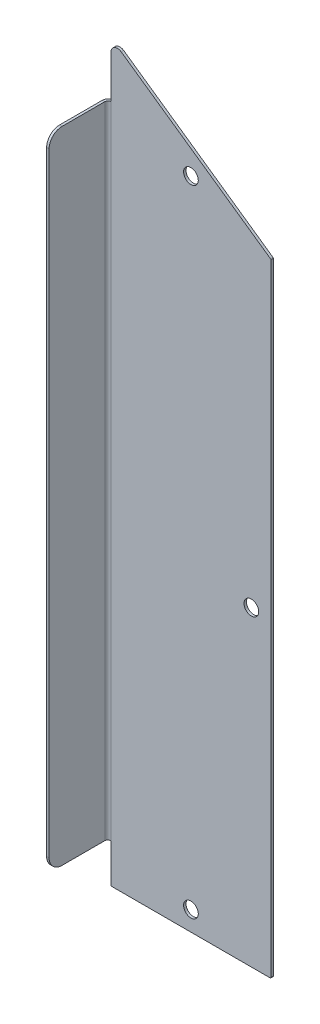
ISO-10303-21;
HEADER;
FILE_DESCRIPTION(('STEP AP214'),'2;1');
FILE_NAME('part.step','',(''),(''),'','','');
FILE_SCHEMA(('AUTOMOTIVE_DESIGN { 1 0 10303 214 1 1 1 1 }'));
ENDSEC;
DATA;
#1=APPLICATION_CONTEXT('core data for automotive mechanical design processes');
#2=APPLICATION_PROTOCOL_DEFINITION('international standard','automotive_design',2000,#1);
#3=PRODUCT_CONTEXT('',#1,'mechanical');
#4=PRODUCT('Part','Part','',(#3));
#5=PRODUCT_RELATED_PRODUCT_CATEGORY('part','',(#4));
#6=PRODUCT_DEFINITION_FORMATION('','',#4);
#7=PRODUCT_DEFINITION_CONTEXT('part definition',#1,'design');
#8=PRODUCT_DEFINITION('design','',#6,#7);
#9=PRODUCT_DEFINITION_SHAPE('','',#8);
#10=(LENGTH_UNIT() NAMED_UNIT(*) SI_UNIT(.MILLI.,.METRE.));
#11=(NAMED_UNIT(*) PLANE_ANGLE_UNIT() SI_UNIT($,.RADIAN.));
#12=(NAMED_UNIT(*) SI_UNIT($,.STERADIAN.) SOLID_ANGLE_UNIT());
#13=UNCERTAINTY_MEASURE_WITH_UNIT(LENGTH_MEASURE(1.E-05),#10,'distance_accuracy_value','');
#14=(GEOMETRIC_REPRESENTATION_CONTEXT(3) GLOBAL_UNCERTAINTY_ASSIGNED_CONTEXT((#13)) GLOBAL_UNIT_ASSIGNED_CONTEXT((#10,
#11,#12)) REPRESENTATION_CONTEXT('',''));
#15=CARTESIAN_POINT('',(0.,0.,0.));
#16=DIRECTION('',(0.,0.,1.));
#17=DIRECTION('',(1.,0.,0.));
#18=AXIS2_PLACEMENT_3D('',#15,#16,#17);
#19=CARTESIAN_POINT('',(-38.89375,-151.360053060756,-1.1938));
#20=DIRECTION('',(-1.,0.,0.));
#21=DIRECTION('',(0.,0.,1.));
#22=AXIS2_PLACEMENT_3D('',#19,#20,#21);
#23=PLANE('',#22);
#24=DIRECTION('',(0.,-1.,0.));
#25=VECTOR('',#24,1.);
#26=CARTESIAN_POINT('',(-38.89375,-151.360053060756,0.));
#27=LINE('',#26,#25);
#28=CARTESIAN_POINT('',(-38.89375,-132.706928060756,0.));
#29=VERTEX_POINT('',#28);
#30=CARTESIAN_POINT('',(-38.89375,-150.963178060756,0.));
#31=VERTEX_POINT('',#30);
#32=EDGE_CURVE('E330',#29,#31,#27,.T.);
#33=ORIENTED_EDGE('',*,*,#32,.F.);
#34=DIRECTION('',(0.,0.,-1.));
#35=VECTOR('',#34,1.);
#36=CARTESIAN_POINT('',(-38.89375,-132.706928060756,-1.1938));
#37=LINE('',#36,#35);
#38=CARTESIAN_POINT('',(-38.89375,-132.706928060756,-1.1938));
#39=VERTEX_POINT('',#38);
#40=EDGE_CURVE('E139',#29,#39,#37,.T.);
#41=ORIENTED_EDGE('',*,*,#40,.T.);
#42=DIRECTION('',(0.,-1.,0.));
#43=VECTOR('',#42,1.);
#44=CARTESIAN_POINT('',(-38.89375,151.360053060756,-1.1938));
#45=LINE('',#44,#43);
#46=CARTESIAN_POINT('',(-38.89375,-150.963178060756,-1.1938));
#47=VERTEX_POINT('',#46);
#48=EDGE_CURVE('E216',#39,#47,#45,.T.);
#49=ORIENTED_EDGE('',*,*,#48,.T.);
#50=DIRECTION('',(0.,0.,1.));
#51=VECTOR('',#50,1.);
#52=CARTESIAN_POINT('',(-38.89375,-150.963178060756,-1.1938));
#53=LINE('',#52,#51);
#54=EDGE_CURVE('E145',#47,#31,#53,.T.);
#55=ORIENTED_EDGE('',*,*,#54,.T.);
#56=EDGE_LOOP('',(#33,#41,#49,#55));
#57=FACE_BOUND('',#56,.T.);
#58=ADVANCED_FACE('F43',(#57),#23,.T.);
#59=CARTESIAN_POINT('',(-38.89375,205.827446939244,-1.1938));
#60=DIRECTION('',(0.573576436351047,0.819152044288991,0.));
#61=DIRECTION('',(-0.819152044288991,0.573576436351047,0.));
#62=AXIS2_PLACEMENT_3D('',#59,#60,#61);
#63=PLANE('',#62);
#64=DIRECTION('',(-0.819152044288991,0.573576436351047,0.));
#65=VECTOR('',#64,1.);
#66=CARTESIAN_POINT('',(-38.89375,205.827446939244,0.));
#67=LINE('',#66,#65);
#68=CARTESIAN_POINT('',(38.7245131481768,151.478553980145,0.));
#69=VERTEX_POINT('',#68);
#70=CARTESIAN_POINT('',(-33.8976448145854,202.329136426728,0.));
#71=VERTEX_POINT('',#70);
#72=EDGE_CURVE('E331',#69,#71,#67,.T.);
#73=ORIENTED_EDGE('',*,*,#72,.F.);
#74=DIRECTION('',(0.,0.,1.));
#75=VECTOR('',#74,1.);
#76=CARTESIAN_POINT('',(38.7245131481768,151.478553980145,-1.1938));
#77=LINE('',#76,#75);
#78=CARTESIAN_POINT('',(38.7245131481768,151.478553980145,-1.1938));
#79=VERTEX_POINT('',#78);
#80=EDGE_CURVE('E100',#69,#79,#77,.F.);
#81=ORIENTED_EDGE('',*,*,#80,.T.);
#82=DIRECTION('',(-0.819152044288991,0.573576436351047,0.));
#83=VECTOR('',#82,1.);
#84=CARTESIAN_POINT('',(-38.89375,205.827446939244,-1.1938));
#85=LINE('',#84,#83);
#86=CARTESIAN_POINT('',(-33.8976448145854,202.329136426728,-1.1938));
#87=VERTEX_POINT('',#86);
#88=EDGE_CURVE('E322',#79,#87,#85,.T.);
#89=ORIENTED_EDGE('',*,*,#88,.T.);
#90=DIRECTION('',(0.,0.,1.));
#91=VECTOR('',#90,1.);
#92=CARTESIAN_POINT('',(-33.8976448145854,202.329136426728,-1.1938));
#93=LINE('',#92,#91);
#94=EDGE_CURVE('E313',#87,#71,#93,.T.);
#95=ORIENTED_EDGE('',*,*,#94,.T.);
#96=EDGE_LOOP('',(#73,#81,#89,#95));
#97=FACE_BOUND('',#96,.T.);
#98=ADVANCED_FACE('F181',(#97),#63,.T.);
#99=CARTESIAN_POINT('',(38.89375,-151.360053060756,-1.1938));
#100=DIRECTION('',(1.,0.,0.));
#101=DIRECTION('',(0.,0.,-1.));
#102=AXIS2_PLACEMENT_3D('',#99,#100,#101);
#103=PLANE('',#102);
#104=DIRECTION('',(0.,1.,0.));
#105=VECTOR('',#104,1.);
#106=CARTESIAN_POINT('',(38.89375,-151.360053060756,0.));
#107=LINE('',#106,#105);
#108=CARTESIAN_POINT('',(38.89375,-150.963178060756,0.));
#109=VERTEX_POINT('',#108);
#110=CARTESIAN_POINT('',(38.89375,151.153453012568,0.));
#111=VERTEX_POINT('',#110);
#112=EDGE_CURVE('E318',#109,#111,#107,.T.);
#113=ORIENTED_EDGE('',*,*,#112,.F.);
#114=DIRECTION('',(0.,0.,1.));
#115=VECTOR('',#114,1.);
#116=CARTESIAN_POINT('',(38.89375,-150.963178060756,-1.1938));
#117=LINE('',#116,#115);
#118=CARTESIAN_POINT('',(38.89375,-150.963178060756,-1.1938));
#119=VERTEX_POINT('',#118);
#120=EDGE_CURVE('E244',#109,#119,#117,.F.);
#121=ORIENTED_EDGE('',*,*,#120,.T.);
#122=DIRECTION('',(0.,1.,0.));
#123=VECTOR('',#122,1.);
#124=CARTESIAN_POINT('',(38.89375,-151.360053060756,-1.1938));
#125=LINE('',#124,#123);
#126=CARTESIAN_POINT('',(38.89375,151.153453012568,-1.1938));
#127=VERTEX_POINT('',#126);
#128=EDGE_CURVE('E317',#119,#127,#125,.T.);
#129=ORIENTED_EDGE('',*,*,#128,.T.);
#130=DIRECTION('',(0.,0.,1.));
#131=VECTOR('',#130,1.);
#132=CARTESIAN_POINT('',(38.89375,151.153453012568,-1.1938));
#133=LINE('',#132,#131);
#134=EDGE_CURVE('E248',#127,#111,#133,.T.);
#135=ORIENTED_EDGE('',*,*,#134,.T.);
#136=EDGE_LOOP('',(#113,#121,#129,#135));
#137=FACE_BOUND('',#136,.T.);
#138=ADVANCED_FACE('F188',(#137),#103,.T.);
#139=CARTESIAN_POINT('',(-38.89375,-151.360053060756,-1.1938));
#140=DIRECTION('',(0.,-1.,0.));
#141=DIRECTION('',(0.,0.,-1.));
#142=AXIS2_PLACEMENT_3D('',#139,#140,#141);
#143=PLANE('',#142);
#144=DIRECTION('',(1.,0.,0.));
#145=VECTOR('',#144,1.);
#146=CARTESIAN_POINT('',(-38.89375,-151.360053060756,-1.1938));
#147=LINE('',#146,#145);
#148=CARTESIAN_POINT('',(-38.496875,-151.360053060756,-1.1938));
#149=VERTEX_POINT('',#148);
#150=CARTESIAN_POINT('',(38.496875,-151.360053060756,-1.1938));
#151=VERTEX_POINT('',#150);
#152=EDGE_CURVE('E215',#149,#151,#147,.T.);
#153=ORIENTED_EDGE('',*,*,#152,.T.);
#154=DIRECTION('',(0.,0.,1.));
#155=VECTOR('',#154,1.);
#156=CARTESIAN_POINT('',(38.496875,-151.360053060756,-1.1938));
#157=LINE('',#156,#155);
#158=CARTESIAN_POINT('',(38.496875,-151.360053060756,0.));
#159=VERTEX_POINT('',#158);
#160=EDGE_CURVE('E264',#151,#159,#157,.T.);
#161=ORIENTED_EDGE('',*,*,#160,.T.);
#162=DIRECTION('',(1.,0.,0.));
#163=VECTOR('',#162,1.);
#164=CARTESIAN_POINT('',(-38.89375,-151.360053060756,0.));
#165=LINE('',#164,#163);
#166=CARTESIAN_POINT('',(-38.496875,-151.360053060756,0.));
#167=VERTEX_POINT('',#166);
#168=EDGE_CURVE('E323',#167,#159,#165,.T.);
#169=ORIENTED_EDGE('',*,*,#168,.F.);
#170=DIRECTION('',(0.,0.,1.));
#171=VECTOR('',#170,1.);
#172=CARTESIAN_POINT('',(-38.496875,-151.360053060756,-1.1938));
#173=LINE('',#172,#171);
#174=EDGE_CURVE('E268',#167,#149,#173,.F.);
#175=ORIENTED_EDGE('',*,*,#174,.T.);
#176=EDGE_LOOP('',(#153,#161,#169,#175));
#177=FACE_BOUND('',#176,.T.);
#178=ADVANCED_FACE('F193',(#177),#143,.T.);
#179=CARTESIAN_POINT('',(-38.89375,199.72832868611,-1.1938));
#180=VERTEX_POINT('',#179);
#181=CARTESIAN_POINT('',(-38.89375,179.236821939244,-1.1938));
#182=VERTEX_POINT('',#181);
#183=EDGE_CURVE('E205',#180,#182,#45,.T.);
#184=ORIENTED_EDGE('',*,*,#183,.T.);
#185=DIRECTION('',(0.,0.,-1.));
#186=VECTOR('',#185,1.);
#187=CARTESIAN_POINT('',(-38.89375,179.236821939244,-1.1938));
#188=LINE('',#187,#186);
#189=CARTESIAN_POINT('',(-38.89375,179.236821939244,0.));
#190=VERTEX_POINT('',#189);
#191=EDGE_CURVE('E208',#182,#190,#188,.F.);
#192=ORIENTED_EDGE('',*,*,#191,.T.);
#193=CARTESIAN_POINT('',(-38.89375,199.72832868611,0.));
#194=VERTEX_POINT('',#193);
#195=EDGE_CURVE('E327',#194,#190,#27,.T.);
#196=ORIENTED_EDGE('',*,*,#195,.F.);
#197=DIRECTION('',(0.,0.,1.));
#198=VECTOR('',#197,1.);
#199=CARTESIAN_POINT('',(-38.89375,199.72832868611,-1.1938));
#200=LINE('',#199,#198);
#201=EDGE_CURVE('E211',#194,#180,#200,.F.);
#202=ORIENTED_EDGE('',*,*,#201,.T.);
#203=EDGE_LOOP('',(#184,#192,#196,#202));
#204=FACE_BOUND('',#203,.T.);
#205=ADVANCED_FACE('F184',(#204),#23,.T.);
#206=CARTESIAN_POINT('',(0.,0.,-1.1938));
#207=DIRECTION('',(0.,0.,1.));
#208=DIRECTION('',(1.,0.,0.));
#209=AXIS2_PLACEMENT_3D('',#206,#207,#208);
#210=PLANE('',#209);
#211=CARTESIAN_POINT('',(29.36875,0.,-1.1938));
#212=DIRECTION('',(0.,0.,-1.));
#213=DIRECTION('',(-1.,0.,0.));
#214=AXIS2_PLACEMENT_3D('',#211,#212,#213);
#215=CIRCLE('',#214,3.571875);
#216=CARTESIAN_POINT('',(25.796875,0.,-1.1938));
#217=VERTEX_POINT('',#216);
#218=EDGE_CURVE('E389',#217,#217,#215,.T.);
#219=ORIENTED_EDGE('',*,*,#218,.F.);
#220=EDGE_LOOP('',(#219));
#221=FACE_BOUND('',#220,.T.);
#222=CARTESIAN_POINT('',(0.,-141.835053060756,-1.1938));
#223=DIRECTION('',(0.,0.,-1.));
#224=DIRECTION('',(-1.,0.,0.));
#225=AXIS2_PLACEMENT_3D('',#222,#223,#224);
#226=CIRCLE('',#225,3.57187500000001);
#227=CARTESIAN_POINT('',(-3.57187500000001,-141.835053060756,-1.1938));
#228=VERTEX_POINT('',#227);
#229=EDGE_CURVE('E406',#228,#228,#226,.T.);
#230=ORIENTED_EDGE('',*,*,#229,.F.);
#231=EDGE_LOOP('',(#230));
#232=FACE_BOUND('',#231,.T.);
#233=CARTESIAN_POINT('',(0.,166.965872042047,-1.1938));
#234=DIRECTION('',(0.,0.,-1.));
#235=DIRECTION('',(-1.,0.,0.));
#236=AXIS2_PLACEMENT_3D('',#233,#234,#235);
#237=CIRCLE('',#236,3.57187500000001);
#238=CARTESIAN_POINT('',(-3.57187500000001,166.965872042047,-1.1938));
#239=VERTEX_POINT('',#238);
#240=EDGE_CURVE('E398',#239,#239,#237,.T.);
#241=ORIENTED_EDGE('',*,*,#240,.F.);
#242=EDGE_LOOP('',(#241));
#243=FACE_BOUND('',#242,.T.);
#244=ORIENTED_EDGE('',*,*,#128,.F.);
#245=CARTESIAN_POINT('',(38.496875,-150.963178060756,-1.1938));
#246=DIRECTION('',(0.,0.,1.));
#247=DIRECTION('',(1.,0.,0.));
#248=AXIS2_PLACEMENT_3D('',#245,#246,#247);
#249=CIRCLE('',#248,0.396875);
#250=EDGE_CURVE('E234',#119,#151,#249,.F.);
#251=ORIENTED_EDGE('',*,*,#250,.T.);
#252=ORIENTED_EDGE('',*,*,#152,.F.);
#253=CARTESIAN_POINT('',(-38.496875,-150.963178060756,-1.1938));
#254=DIRECTION('',(0.,0.,1.));
#255=DIRECTION('',(1.,0.,0.));
#256=AXIS2_PLACEMENT_3D('',#253,#254,#255);
#257=CIRCLE('',#256,0.396875);
#258=EDGE_CURVE('E241',#149,#47,#257,.F.);
#259=ORIENTED_EDGE('',*,*,#258,.T.);
#260=ORIENTED_EDGE('',*,*,#48,.F.);
#261=DIRECTION('',(0.,1.,0.));
#262=VECTOR('',#261,1.);
#263=CARTESIAN_POINT('',(-38.89375,-1937.29755306076,-1.1938));
#264=LINE('',#263,#262);
#265=EDGE_CURVE('E73',#39,#182,#264,.T.);
#266=ORIENTED_EDGE('',*,*,#265,.T.);
#267=ORIENTED_EDGE('',*,*,#183,.F.);
#268=CARTESIAN_POINT('',(-35.71875,199.72832868611,-1.1938));
#269=DIRECTION('',(0.,0.,1.));
#270=DIRECTION('',(1.,0.,0.));
#271=AXIS2_PLACEMENT_3D('',#268,#269,#270);
#272=CIRCLE('',#271,3.175);
#273=EDGE_CURVE('E304',#180,#87,#272,.F.);
#274=ORIENTED_EDGE('',*,*,#273,.T.);
#275=ORIENTED_EDGE('',*,*,#88,.F.);
#276=CARTESIAN_POINT('',(38.496875,151.153453012568,-1.1938));
#277=DIRECTION('',(0.,0.,1.));
#278=DIRECTION('',(1.,0.,0.));
#279=AXIS2_PLACEMENT_3D('',#276,#277,#278);
#280=CIRCLE('',#279,0.396875);
#281=EDGE_CURVE('E238',#79,#127,#280,.F.);
#282=ORIENTED_EDGE('',*,*,#281,.T.);
#283=EDGE_LOOP('',(#244,#251,#252,#259,#260,#266,#267,#274,#275,#282));
#284=FACE_BOUND('',#283,.T.);
#285=ADVANCED_FACE('F192',(#221,#232,#243,#284),#210,.F.);
#286=CARTESIAN_POINT('',(0.,0.,0.));
#287=DIRECTION('',(0.,0.,1.));
#288=DIRECTION('',(1.,0.,0.));
#289=AXIS2_PLACEMENT_3D('',#286,#287,#288);
#290=PLANE('',#289);
#291=CARTESIAN_POINT('',(29.36875,0.,0.));
#292=DIRECTION('',(0.,0.,1.));
#293=DIRECTION('',(1.,0.,0.));
#294=AXIS2_PLACEMENT_3D('',#291,#292,#293);
#295=CIRCLE('',#294,3.571875);
#296=CARTESIAN_POINT('',(32.940625,0.,0.));
#297=VERTEX_POINT('',#296);
#298=EDGE_CURVE('E410',#297,#297,#295,.F.);
#299=ORIENTED_EDGE('',*,*,#298,.T.);
#300=EDGE_LOOP('',(#299));
#301=FACE_BOUND('',#300,.T.);
#302=CARTESIAN_POINT('',(0.,-141.835053060756,0.));
#303=DIRECTION('',(0.,0.,1.));
#304=DIRECTION('',(1.,0.,0.));
#305=AXIS2_PLACEMENT_3D('',#302,#303,#304);
#306=CIRCLE('',#305,3.57187500000001);
#307=CARTESIAN_POINT('',(3.57187500000001,-141.835053060756,0.));
#308=VERTEX_POINT('',#307);
#309=EDGE_CURVE('E402',#308,#308,#306,.F.);
#310=ORIENTED_EDGE('',*,*,#309,.T.);
#311=EDGE_LOOP('',(#310));
#312=FACE_BOUND('',#311,.T.);
#313=CARTESIAN_POINT('',(0.,166.965872042047,0.));
#314=DIRECTION('',(0.,0.,1.));
#315=DIRECTION('',(1.,0.,0.));
#316=AXIS2_PLACEMENT_3D('',#313,#314,#315);
#317=CIRCLE('',#316,3.57187500000001);
#318=CARTESIAN_POINT('',(3.57187500000001,166.965872042047,0.));
#319=VERTEX_POINT('',#318);
#320=EDGE_CURVE('E394',#319,#319,#317,.F.);
#321=ORIENTED_EDGE('',*,*,#320,.T.);
#322=EDGE_LOOP('',(#321));
#323=FACE_BOUND('',#322,.T.);
#324=ORIENTED_EDGE('',*,*,#168,.T.);
#325=CARTESIAN_POINT('',(38.496875,-150.963178060756,0.));
#326=DIRECTION('',(0.,0.,1.));
#327=DIRECTION('',(1.,0.,0.));
#328=AXIS2_PLACEMENT_3D('',#325,#326,#327);
#329=CIRCLE('',#328,0.396875);
#330=EDGE_CURVE('E252',#159,#109,#329,.T.);
#331=ORIENTED_EDGE('',*,*,#330,.T.);
#332=ORIENTED_EDGE('',*,*,#112,.T.);
#333=CARTESIAN_POINT('',(38.496875,151.153453012568,0.));
#334=DIRECTION('',(0.,0.,1.));
#335=DIRECTION('',(1.,0.,0.));
#336=AXIS2_PLACEMENT_3D('',#333,#334,#335);
#337=CIRCLE('',#336,0.396875);
#338=EDGE_CURVE('E256',#111,#69,#337,.T.);
#339=ORIENTED_EDGE('',*,*,#338,.T.);
#340=ORIENTED_EDGE('',*,*,#72,.T.);
#341=CARTESIAN_POINT('',(-35.71875,199.72832868611,0.));
#342=DIRECTION('',(0.,0.,1.));
#343=DIRECTION('',(1.,0.,0.));
#344=AXIS2_PLACEMENT_3D('',#341,#342,#343);
#345=CIRCLE('',#344,3.175);
#346=EDGE_CURVE('E309',#71,#194,#345,.T.);
#347=ORIENTED_EDGE('',*,*,#346,.T.);
#348=ORIENTED_EDGE('',*,*,#195,.T.);
#349=DIRECTION('',(0.,1.,0.));
#350=VECTOR('',#349,1.);
#351=CARTESIAN_POINT('',(-38.89375,-1937.29755306076,0.));
#352=LINE('',#351,#350);
#353=EDGE_CURVE('E64',#29,#190,#352,.T.);
#354=ORIENTED_EDGE('',*,*,#353,.F.);
#355=ORIENTED_EDGE('',*,*,#32,.T.);
#356=CARTESIAN_POINT('',(-38.496875,-150.963178060756,0.));
#357=DIRECTION('',(0.,0.,1.));
#358=DIRECTION('',(1.,0.,0.));
#359=AXIS2_PLACEMENT_3D('',#356,#357,#358);
#360=CIRCLE('',#359,0.396875);
#361=EDGE_CURVE('E260',#31,#167,#360,.T.);
#362=ORIENTED_EDGE('',*,*,#361,.T.);
#363=EDGE_LOOP('',(#324,#331,#332,#339,#340,#347,#348,#354,#355,#362));
#364=FACE_BOUND('',#363,.T.);
#365=ADVANCED_FACE('F199',(#301,#312,#323,#364),#290,.T.);
#366=CARTESIAN_POINT('',(-40.39235,-151.360053060756,28.575));
#367=DIRECTION('',(0.,0.,-1.));
#368=DIRECTION('',(0.,1.,0.));
#369=AXIS2_PLACEMENT_3D('',#366,#367,#368);
#370=PLANE('',#369);
#371=DIRECTION('',(0.,1.,0.));
#372=VECTOR('',#371,1.);
#373=CARTESIAN_POINT('',(-41.58615,-151.360053060756,28.575));
#374=LINE('',#373,#372);
#375=CARTESIAN_POINT('',(-41.58615,-125.960053060756,28.575));
#376=VERTEX_POINT('',#375);
#377=CARTESIAN_POINT('',(-41.58615,172.489946939244,28.575));
#378=VERTEX_POINT('',#377);
#379=EDGE_CURVE('E354',#376,#378,#374,.T.);
#380=ORIENTED_EDGE('',*,*,#379,.F.);
#381=DIRECTION('',(1.,0.,0.));
#382=VECTOR('',#381,1.);
#383=CARTESIAN_POINT('',(-40.39235,-125.960053060756,28.575));
#384=LINE('',#383,#382);
#385=CARTESIAN_POINT('',(-40.39235,-125.960053060756,28.575));
#386=VERTEX_POINT('',#385);
#387=EDGE_CURVE('E284',#376,#386,#384,.T.);
#388=ORIENTED_EDGE('',*,*,#387,.T.);
#389=DIRECTION('',(0.,1.,0.));
#390=VECTOR('',#389,1.);
#391=CARTESIAN_POINT('',(-40.39235,-151.360053060756,28.575));
#392=LINE('',#391,#390);
#393=CARTESIAN_POINT('',(-40.39235,172.489946939244,28.575));
#394=VERTEX_POINT('',#393);
#395=EDGE_CURVE('E363',#386,#394,#392,.T.);
#396=ORIENTED_EDGE('',*,*,#395,.T.);
#397=DIRECTION('',(1.,0.,0.));
#398=VECTOR('',#397,1.);
#399=CARTESIAN_POINT('',(-40.39235,172.489946939244,28.575));
#400=LINE('',#399,#398);
#401=EDGE_CURVE('E288',#394,#378,#400,.F.);
#402=ORIENTED_EDGE('',*,*,#401,.T.);
#403=EDGE_LOOP('',(#380,#388,#396,#402));
#404=FACE_BOUND('',#403,.T.);
#405=ADVANCED_FACE('F517',(#404),#370,.F.);
#406=CARTESIAN_POINT('',(-40.39235,-132.310053060756,28.575));
#407=DIRECTION('',(0.,-1.,0.));
#408=DIRECTION('',(0.,0.,-1.));
#409=AXIS2_PLACEMENT_3D('',#406,#407,#408);
#410=PLANE('',#409);
#411=DIRECTION('',(0.,0.,-1.));
#412=VECTOR('',#411,1.);
#413=CARTESIAN_POINT('',(-40.39235,-132.310053060756,28.575));
#414=LINE('',#413,#412);
#415=CARTESIAN_POINT('',(-40.39235,-132.310053060756,22.225));
#416=VERTEX_POINT('',#415);
#417=CARTESIAN_POINT('',(-40.39235,-132.310053060756,1.4986));
#418=VERTEX_POINT('',#417);
#419=EDGE_CURVE('E355',#416,#418,#414,.T.);
#420=ORIENTED_EDGE('',*,*,#419,.F.);
#421=DIRECTION('',(-1.,0.,0.));
#422=VECTOR('',#421,1.);
#423=CARTESIAN_POINT('',(-40.39235,-132.310053060756,22.225));
#424=LINE('',#423,#422);
#425=CARTESIAN_POINT('',(-41.58615,-132.310053060756,22.225));
#426=VERTEX_POINT('',#425);
#427=EDGE_CURVE('E300',#416,#426,#424,.T.);
#428=ORIENTED_EDGE('',*,*,#427,.T.);
#429=DIRECTION('',(0.,0.,-1.));
#430=VECTOR('',#429,1.);
#431=CARTESIAN_POINT('',(-41.58615,-132.310053060756,28.575));
#432=LINE('',#431,#430);
#433=CARTESIAN_POINT('',(-41.58615,-132.310053060756,1.4986));
#434=VERTEX_POINT('',#433);
#435=EDGE_CURVE('E370',#426,#434,#432,.T.);
#436=ORIENTED_EDGE('',*,*,#435,.T.);
#437=DIRECTION('',(1.,0.,0.));
#438=VECTOR('',#437,1.);
#439=CARTESIAN_POINT('',(-40.39235,-132.310053060756,1.4986));
#440=LINE('',#439,#438);
#441=EDGE_CURVE('E130',#418,#434,#440,.F.);
#442=ORIENTED_EDGE('',*,*,#441,.F.);
#443=EDGE_LOOP('',(#420,#428,#436,#442));
#444=FACE_BOUND('',#443,.T.);
#445=ADVANCED_FACE('F524',(#444),#410,.T.);
#446=CARTESIAN_POINT('',(-40.39235,178.839946939244,28.575));
#447=DIRECTION('',(0.,1.,0.));
#448=DIRECTION('',(0.,0.,1.));
#449=AXIS2_PLACEMENT_3D('',#446,#447,#448);
#450=PLANE('',#449);
#451=DIRECTION('',(0.,0.,-1.));
#452=VECTOR('',#451,1.);
#453=CARTESIAN_POINT('',(-41.58615,178.839946939244,28.575));
#454=LINE('',#453,#452);
#455=CARTESIAN_POINT('',(-41.58615,178.839946939244,1.4986));
#456=VERTEX_POINT('',#455);
#457=CARTESIAN_POINT('',(-41.58615,178.839946939244,22.225));
#458=VERTEX_POINT('',#457);
#459=EDGE_CURVE('E347',#456,#458,#454,.F.);
#460=ORIENTED_EDGE('',*,*,#459,.T.);
#461=DIRECTION('',(-1.,0.,0.));
#462=VECTOR('',#461,1.);
#463=CARTESIAN_POINT('',(-40.39235,178.839946939244,22.225));
#464=LINE('',#463,#462);
#465=CARTESIAN_POINT('',(-40.39235,178.839946939244,22.225));
#466=VERTEX_POINT('',#465);
#467=EDGE_CURVE('E272',#458,#466,#464,.F.);
#468=ORIENTED_EDGE('',*,*,#467,.T.);
#469=DIRECTION('',(0.,0.,1.));
#470=VECTOR('',#469,1.);
#471=CARTESIAN_POINT('',(-40.39235,178.839946939244,28.575));
#472=LINE('',#471,#470);
#473=CARTESIAN_POINT('',(-40.39235,178.839946939244,1.4986));
#474=VERTEX_POINT('',#473);
#475=EDGE_CURVE('E350',#474,#466,#472,.T.);
#476=ORIENTED_EDGE('',*,*,#475,.F.);
#477=DIRECTION('',(1.,0.,0.));
#478=VECTOR('',#477,1.);
#479=CARTESIAN_POINT('',(-40.39235,178.839946939244,1.4986));
#480=LINE('',#479,#478);
#481=EDGE_CURVE('E343',#474,#456,#480,.F.);
#482=ORIENTED_EDGE('',*,*,#481,.T.);
#483=EDGE_LOOP('',(#460,#468,#476,#482));
#484=FACE_BOUND('',#483,.T.);
#485=ADVANCED_FACE('F520',(#484),#450,.T.);
#486=CARTESIAN_POINT('',(-41.58615,-151.360053060756,28.575));
#487=DIRECTION('',(1.,0.,0.));
#488=DIRECTION('',(0.,0.,-1.));
#489=AXIS2_PLACEMENT_3D('',#486,#487,#488);
#490=PLANE('',#489);
#491=ORIENTED_EDGE('',*,*,#435,.F.);
#492=CARTESIAN_POINT('',(-41.58615,-125.960053060756,22.225));
#493=DIRECTION('',(1.,0.,0.));
#494=DIRECTION('',(0.,0.,-1.));
#495=AXIS2_PLACEMENT_3D('',#492,#493,#494);
#496=CIRCLE('',#495,6.35);
#497=EDGE_CURVE('E292',#426,#376,#496,.F.);
#498=ORIENTED_EDGE('',*,*,#497,.T.);
#499=ORIENTED_EDGE('',*,*,#379,.T.);
#500=CARTESIAN_POINT('',(-41.58615,172.489946939244,22.225));
#501=DIRECTION('',(1.,0.,0.));
#502=DIRECTION('',(0.,0.,-1.));
#503=AXIS2_PLACEMENT_3D('',#500,#501,#502);
#504=CIRCLE('',#503,6.35);
#505=EDGE_CURVE('E296',#378,#458,#504,.F.);
#506=ORIENTED_EDGE('',*,*,#505,.T.);
#507=ORIENTED_EDGE('',*,*,#459,.F.);
#508=DIRECTION('',(0.,1.,0.));
#509=VECTOR('',#508,1.);
#510=CARTESIAN_POINT('',(-41.58615,-151.360053060756,1.4986));
#511=LINE('',#510,#509);
#512=EDGE_CURVE('E374',#434,#456,#511,.T.);
#513=ORIENTED_EDGE('',*,*,#512,.F.);
#514=EDGE_LOOP('',(#491,#498,#499,#506,#507,#513));
#515=FACE_BOUND('',#514,.T.);
#516=ADVANCED_FACE('F523',(#515),#490,.F.);
#517=CARTESIAN_POINT('',(-40.39235,-151.360053060756,28.575));
#518=DIRECTION('',(1.,0.,0.));
#519=DIRECTION('',(0.,0.,-1.));
#520=AXIS2_PLACEMENT_3D('',#517,#518,#519);
#521=PLANE('',#520);
#522=ORIENTED_EDGE('',*,*,#395,.F.);
#523=CARTESIAN_POINT('',(-40.39235,-125.960053060756,22.225));
#524=DIRECTION('',(1.,0.,0.));
#525=DIRECTION('',(0.,0.,-1.));
#526=AXIS2_PLACEMENT_3D('',#523,#524,#525);
#527=CIRCLE('',#526,6.35);
#528=EDGE_CURVE('E276',#386,#416,#527,.T.);
#529=ORIENTED_EDGE('',*,*,#528,.T.);
#530=ORIENTED_EDGE('',*,*,#419,.T.);
#531=DIRECTION('',(0.,1.,0.));
#532=VECTOR('',#531,1.);
#533=CARTESIAN_POINT('',(-40.39235,-151.360053060756,1.4986));
#534=LINE('',#533,#532);
#535=EDGE_CURVE('E359',#418,#474,#534,.T.);
#536=ORIENTED_EDGE('',*,*,#535,.T.);
#537=ORIENTED_EDGE('',*,*,#475,.T.);
#538=CARTESIAN_POINT('',(-40.39235,172.489946939244,22.225));
#539=DIRECTION('',(1.,0.,0.));
#540=DIRECTION('',(0.,0.,-1.));
#541=AXIS2_PLACEMENT_3D('',#538,#539,#540);
#542=CIRCLE('',#541,6.35);
#543=EDGE_CURVE('E280',#466,#394,#542,.T.);
#544=ORIENTED_EDGE('',*,*,#543,.T.);
#545=EDGE_LOOP('',(#522,#529,#530,#536,#537,#544));
#546=FACE_BOUND('',#545,.T.);
#547=ADVANCED_FACE('F532',(#546),#521,.T.);
#548=CARTESIAN_POINT('',(-38.89375,-132.310053060756,1.4986));
#549=DIRECTION('',(0.,1.,0.));
#550=DIRECTION('',(0.,0.,1.));
#551=AXIS2_PLACEMENT_3D('',#548,#549,#550);
#552=PLANE('',#551);
#553=CARTESIAN_POINT('',(-38.89375,-132.310053060756,1.4986));
#554=DIRECTION('',(0.,1.,0.));
#555=DIRECTION('',(0.,0.,1.));
#556=AXIS2_PLACEMENT_3D('',#553,#554,#555);
#557=CIRCLE('',#556,2.6924);
#558=CARTESIAN_POINT('',(-39.290625,-132.310053060756,-1.16438854567101));
#559=VERTEX_POINT('',#558);
#560=EDGE_CURVE('E116',#434,#559,#557,.F.);
#561=ORIENTED_EDGE('',*,*,#560,.T.);
#562=DIRECTION('',(0.,0.,-1.));
#563=VECTOR('',#562,1.);
#564=CARTESIAN_POINT('',(-39.290625,-132.310053060756,1.4986));
#565=LINE('',#564,#563);
#566=CARTESIAN_POINT('',(-39.290625,-132.310053060756,0.0535075481565195));
#567=VERTEX_POINT('',#566);
#568=EDGE_CURVE('E127',#559,#567,#565,.F.);
#569=ORIENTED_EDGE('',*,*,#568,.T.);
#570=CARTESIAN_POINT('',(-38.89375,-132.310053060756,1.4986));
#571=DIRECTION('',(0.,-1.,0.));
#572=DIRECTION('',(0.,0.,-1.));
#573=AXIS2_PLACEMENT_3D('',#570,#571,#572);
#574=CIRCLE('',#573,1.4986);
#575=EDGE_CURVE('E384',#418,#567,#574,.T.);
#576=ORIENTED_EDGE('',*,*,#575,.F.);
#577=ORIENTED_EDGE('',*,*,#441,.T.);
#578=EDGE_LOOP('',(#561,#569,#576,#577));
#579=FACE_BOUND('',#578,.T.);
#580=ADVANCED_FACE('F125',(#579),#552,.F.);
#581=CARTESIAN_POINT('',(-38.89375,178.839946939244,1.4986));
#582=DIRECTION('',(0.,-1.,0.));
#583=DIRECTION('',(0.,0.,-1.));
#584=AXIS2_PLACEMENT_3D('',#581,#582,#583);
#585=PLANE('',#584);
#586=CARTESIAN_POINT('',(-38.89375,178.839946939244,1.4986));
#587=DIRECTION('',(0.,1.,0.));
#588=DIRECTION('',(0.,0.,1.));
#589=AXIS2_PLACEMENT_3D('',#586,#587,#588);
#590=CIRCLE('',#589,1.4986);
#591=CARTESIAN_POINT('',(-39.290625,178.839946939244,0.0535075481565195));
#592=VERTEX_POINT('',#591);
#593=EDGE_CURVE('E380',#592,#474,#590,.T.);
#594=ORIENTED_EDGE('',*,*,#593,.F.);
#595=DIRECTION('',(0.,0.,-1.));
#596=VECTOR('',#595,1.);
#597=CARTESIAN_POINT('',(-39.290625,178.839946939244,1.4986));
#598=LINE('',#597,#596);
#599=CARTESIAN_POINT('',(-39.290625,178.839946939244,-1.16438854567101));
#600=VERTEX_POINT('',#599);
#601=EDGE_CURVE('E224',#592,#600,#598,.T.);
#602=ORIENTED_EDGE('',*,*,#601,.T.);
#603=CARTESIAN_POINT('',(-38.89375,178.839946939244,1.4986));
#604=DIRECTION('',(0.,1.,0.));
#605=DIRECTION('',(0.,0.,1.));
#606=AXIS2_PLACEMENT_3D('',#603,#604,#605);
#607=CIRCLE('',#606,2.6924);
#608=EDGE_CURVE('E133',#600,#456,#607,.T.);
#609=ORIENTED_EDGE('',*,*,#608,.T.);
#610=ORIENTED_EDGE('',*,*,#481,.F.);
#611=EDGE_LOOP('',(#594,#602,#609,#610));
#612=FACE_BOUND('',#611,.T.);
#613=ADVANCED_FACE('F539',(#612),#585,.F.);
#614=CARTESIAN_POINT('',(-38.89375,-1937.29755306076,1.4986));
#615=DIRECTION('',(0.,1.,0.));
#616=DIRECTION('',(0.,0.,1.));
#617=AXIS2_PLACEMENT_3D('',#614,#615,#616);
#618=CYLINDRICAL_SURFACE('',#617,2.6924);
#619=ORIENTED_EDGE('',*,*,#265,.F.);
#620=CARTESIAN_POINT('',(-38.89375,-132.706928060756,-1.1938));
#621=CARTESIAN_POINT('',(-38.8937310427472,-132.684605368508,-1.19379209465876));
#622=CARTESIAN_POINT('',(-38.8956322163208,-132.662288289707,-1.19379986760226));
#623=CARTESIAN_POINT('',(-38.9031351119323,-132.618301417082,-1.19378834276621));
#624=CARTESIAN_POINT('',(-38.9087340710749,-132.596631152599,-1.19376906518606));
#625=CARTESIAN_POINT('',(-38.923496839988,-132.554528436603,-1.19364514403808));
#626=CARTESIAN_POINT('',(-38.9326624034385,-132.534096599739,-1.1935404584478));
#627=CARTESIAN_POINT('',(-38.9542895938263,-132.495065687646,-1.19314107343946));
#628=CARTESIAN_POINT('',(-38.966750651143,-132.476466296444,-1.19284640684665));
#629=CARTESIAN_POINT('',(-38.9946008606571,-132.441642987353,-1.19194641119842));
#630=CARTESIAN_POINT('',(-39.0099873157349,-132.425416905543,-1.19134136743469));
#631=CARTESIAN_POINT('',(-39.0432521510483,-132.395780849544,-1.18969752421862));
#632=CARTESIAN_POINT('',(-39.0611307915376,-132.382371169832,-1.1886586794427));
#633=CARTESIAN_POINT('',(-39.0987827540679,-132.358792852871,-1.18604779762688));
#634=CARTESIAN_POINT('',(-39.1185489696699,-132.348612637958,-1.1844777079366));
#635=CARTESIAN_POINT('',(-39.1594505786127,-132.331705327416,-1.18073604294285));
#636=CARTESIAN_POINT('',(-39.1805853710344,-132.324976727666,-1.17856473027259));
#637=CARTESIAN_POINT('',(-39.2166388474968,-132.31672402869,-1.17440871609831));
#638=CARTESIAN_POINT('',(-39.2313606891187,-132.314220901538,-1.17259021670435));
#639=CARTESIAN_POINT('',(-39.2609347501785,-132.310885482684,-1.16868657187225));
#640=CARTESIAN_POINT('',(-39.2757867395765,-132.310050677515,-1.16660183259653));
#641=CARTESIAN_POINT('',(-39.290625,-132.310053060756,-1.16438854567101));
#642=B_SPLINE_CURVE_WITH_KNOTS('',3,(#620,#621,#622,#623,#624,#625,#626,#627,#628,#629,#630,
#631,#632,#633,#634,#635,#636,#637,#638,#639,#640,#641),.UNSPECIFIED.,.F.,.F.,(4,2,2,2,2,2,2,2,
2,2,4),(0.,0.0668792384095782,0.133708562729278,0.200570788268891,0.267421464329829,
0.334210802567491,0.401007120708361,0.467561193909487,0.534086239928707,0.579126615554536,
0.624099082740789),.UNSPECIFIED.);
#643=EDGE_CURVE('E57',#39,#559,#642,.T.);
#644=ORIENTED_EDGE('',*,*,#643,.T.);
#645=ORIENTED_EDGE('',*,*,#560,.F.);
#646=ORIENTED_EDGE('',*,*,#512,.T.);
#647=ORIENTED_EDGE('',*,*,#608,.F.);
#648=CARTESIAN_POINT('',(-39.290625,178.839946939244,-1.16438854567101));
#649=CARTESIAN_POINT('',(-39.2685672554664,178.839926465502,-1.1676866539015));
#650=CARTESIAN_POINT('',(-39.2464661312687,178.841784927119,-1.17068982996725));
#651=CARTESIAN_POINT('',(-39.2028197234854,178.849155602296,-1.17608907567577));
#652=CARTESIAN_POINT('',(-39.1812741054317,178.854665561283,-1.17848551867787));
#653=CARTESIAN_POINT('',(-39.1393352970705,178.869241334299,-1.18265988010334));
#654=CARTESIAN_POINT('',(-39.1189430696566,178.878310070625,-1.1844372879353));
#655=CARTESIAN_POINT('',(-39.0799395361583,178.899751865474,-1.18742551628356));
#656=CARTESIAN_POINT('',(-39.0613277201144,178.912123973947,-1.18863649942855));
#657=CARTESIAN_POINT('',(-39.0265262271576,178.939748715025,-1.19058038784108));
#658=CARTESIAN_POINT('',(-39.0103234367183,178.954984646889,-1.19131596033131));
#659=CARTESIAN_POINT('',(-38.9806775236242,178.987956740858,-1.19243733806057));
#660=CARTESIAN_POINT('',(-38.9672350584764,179.005693496964,-1.19282306004012));
#661=CARTESIAN_POINT('',(-38.9434665762202,179.043210512181,-1.19336735874526));
#662=CARTESIAN_POINT('',(-38.9331487359388,179.062995954205,-1.19352534349456));
#663=CARTESIAN_POINT('',(-38.9159723750569,179.10401075601,-1.1937220642185));
#664=CARTESIAN_POINT('',(-38.9091120127957,179.125239340234,-1.1937608637346));
#665=CARTESIAN_POINT('',(-38.9006454969776,179.161620709929,-1.19379336937308));
#666=CARTESIAN_POINT('',(-38.89806160889,179.176553476431,-1.19379750643861));
#667=CARTESIAN_POINT('',(-38.8946138250137,179.206596117115,-1.19380000819219));
#668=CARTESIAN_POINT('',(-38.8937476508287,179.221705729914,-1.19379838053465));
#669=CARTESIAN_POINT('',(-38.89375,179.236821939244,-1.1938));
#670=B_SPLINE_CURVE_WITH_KNOTS('',3,(#648,#649,#650,#651,#652,#653,#654,#655,#656,#657,#658,
#659,#660,#661,#662,#663,#664,#665,#666,#667,#668,#669),.UNSPECIFIED.,.F.,.F.,(4,2,2,2,2,2,2,2,
2,2,4),(0.,0.06682868758399,0.133616150954778,0.200458572091965,0.267281790007874,
0.333726774627771,0.400187568071046,0.466820808969263,0.533418519387607,0.578789794913435,
0.624100849080136),.UNSPECIFIED.);
#671=EDGE_CURVE('E138',#600,#182,#670,.T.);
#672=ORIENTED_EDGE('',*,*,#671,.T.);
#673=EDGE_LOOP('',(#619,#644,#645,#646,#647,#672));
#674=FACE_BOUND('',#673,.T.);
#675=ADVANCED_FACE('F113',(#674),#618,.T.);
#676=CARTESIAN_POINT('',(-38.89375,-1937.29755306076,1.4986));
#677=DIRECTION('',(0.,1.,0.));
#678=DIRECTION('',(0.,0.,1.));
#679=AXIS2_PLACEMENT_3D('',#676,#677,#678);
#680=CYLINDRICAL_SURFACE('',#679,1.4986);
#681=ORIENTED_EDGE('',*,*,#353,.T.);
#682=CARTESIAN_POINT('',(-38.89375,179.236821939244,0.));
#683=CARTESIAN_POINT('',(-38.8937310561137,179.214509994418,1.41798680071082E-05));
#684=CARTESIAN_POINT('',(-38.8956304080588,179.192203547809,2.38851227370902E-07));
#685=CARTESIAN_POINT('',(-38.9031264874801,179.148235189695,2.09030467458226E-05));
#686=CARTESIAN_POINT('',(-38.9087207702123,179.126572861906,5.54761767463776E-05));
#687=CARTESIAN_POINT('',(-38.923471658595,179.084484233248,0.000277756144275371));
#688=CARTESIAN_POINT('',(-38.9326301109739,179.064058579495,0.000465542422607586));
#689=CARTESIAN_POINT('',(-38.9542393834928,179.025040404138,0.00118216256573464));
#690=CARTESIAN_POINT('',(-38.9666896542727,179.00644757737,0.00171093954492542));
#691=CARTESIAN_POINT('',(-38.9944787810362,178.971678471347,0.00332477335279479));
#692=CARTESIAN_POINT('',(-39.0098090719013,178.955495275373,0.00440819674693574));
#693=CARTESIAN_POINT('',(-39.0429169620858,178.925948062853,0.00734996141050774));
#694=CARTESIAN_POINT('',(-39.0606943307137,178.912583780863,0.00920822966700367));
#695=CARTESIAN_POINT('',(-39.0979102701618,178.889189578277,0.013855042540161));
#696=CARTESIAN_POINT('',(-39.1173264191113,178.87912167449,0.0166321901082076));
#697=CARTESIAN_POINT('',(-39.1573959378894,178.862347452449,0.0232341768450007));
#698=CARTESIAN_POINT('',(-39.178049171613,178.855640765149,0.0270589009233923));
#699=CARTESIAN_POINT('',(-39.2141200176894,178.847079735406,0.0345631135036948));
#700=CARTESIAN_POINT('',(-39.2294003398971,178.84439537004,0.0379884575705457));
#701=CARTESIAN_POINT('',(-39.2600178112747,178.840828586584,0.0453620714348923));
#702=CARTESIAN_POINT('',(-39.2753548207233,178.839943130179,0.0493094474989352));
#703=CARTESIAN_POINT('',(-39.290625,178.839946939244,0.0535075481561426));
#704=B_SPLINE_CURVE_WITH_KNOTS('',3,(#682,#683,#684,#685,#686,#687,#688,#689,#690,#691,#692,
#693,#694,#695,#696,#697,#698,#699,#700,#701,#702,#703),.UNSPECIFIED.,.F.,.F.,(4,2,2,2,2,2,2,2,
2,2,4),(0.,0.0668473191161143,0.13365045307538,0.200488246395052,0.267314892416598,
0.333945856419024,0.400570543263938,0.466398047959158,0.532218323517395,0.579776147287971,
0.627253580021404),.UNSPECIFIED.);
#705=EDGE_CURVE('E123',#190,#592,#704,.T.);
#706=ORIENTED_EDGE('',*,*,#705,.T.);
#707=ORIENTED_EDGE('',*,*,#593,.T.);
#708=ORIENTED_EDGE('',*,*,#535,.F.);
#709=ORIENTED_EDGE('',*,*,#575,.T.);
#710=CARTESIAN_POINT('',(-39.290625,-132.310053060756,0.0535075481565195));
#711=CARTESIAN_POINT('',(-39.269174925977,-132.310029804781,0.0475970498547418));
#712=CARTESIAN_POINT('',(-39.2475740896366,-132.311791560663,0.0421974466111357));
#713=CARTESIAN_POINT('',(-39.2047223679976,-132.318859574088,0.0324602491021058));
#714=CARTESIAN_POINT('',(-39.1834714043738,-132.324165026944,0.0281224140402535));
#715=CARTESIAN_POINT('',(-39.141928178843,-132.338305952894,0.0205403396623852));
#716=CARTESIAN_POINT('',(-39.1216374652779,-132.347146923511,0.017297818047288));
#717=CARTESIAN_POINT('',(-39.0827174873604,-132.368146970016,0.011832136537242));
#718=CARTESIAN_POINT('',(-39.06408733143,-132.380304250916,0.00960842693897189));
#719=CARTESIAN_POINT('',(-39.0293859876131,-132.407362504142,0.00605032192776632));
#720=CARTESIAN_POINT('',(-39.0132749498732,-132.422210446202,0.00470071446331451));
#721=CARTESIAN_POINT('',(-38.9836919796763,-132.454381907574,0.00262780905979143));
#722=CARTESIAN_POINT('',(-38.9702209188925,-132.47170624129,0.00190471771643282));
#723=CARTESIAN_POINT('',(-38.9462233972002,-132.508476624003,0.000870259100335944));
#724=CARTESIAN_POINT('',(-38.9357191583677,-132.527937243437,0.000561937106167485));
#725=CARTESIAN_POINT('',(-38.9180859072914,-132.568329630271,0.000171562869180808));
#726=CARTESIAN_POINT('',(-38.9109554935658,-132.589260782658,8.94166048509699E-05));
#727=CARTESIAN_POINT('',(-38.9016736317397,-132.626366989953,1.56450981028081E-05));
#728=CARTESIAN_POINT('',(-38.8987054919856,-132.642342929353,5.87832124009608E-06));
#729=CARTESIAN_POINT('',(-38.8947429029786,-132.674519932405,2.33322592118469E-08));
#730=CARTESIAN_POINT('',(-38.8937463051787,-132.69072073159,3.92021689577085E-06));
#731=CARTESIAN_POINT('',(-38.89375,-132.706928060756,0.));
#732=B_SPLINE_CURVE_WITH_KNOTS('',3,(#710,#711,#712,#713,#714,#715,#716,#717,#718,#719,#720,
#721,#722,#723,#724,#725,#726,#727,#728,#729,#730,#731),.UNSPECIFIED.,.F.,.F.,(4,2,2,2,2,2,2,2,
2,2,4),(0.,0.0666868760544821,0.133358614274549,0.200134428756059,0.266874171577588,
0.332418792754433,0.39798501926482,0.464030059231196,0.530047640050156,0.578679586698618,
0.627258505960193),.UNSPECIFIED.);
#733=EDGE_CURVE('E11',#567,#29,#732,.T.);
#734=ORIENTED_EDGE('',*,*,#733,.T.);
#735=EDGE_LOOP('',(#681,#706,#707,#708,#709,#734));
#736=FACE_BOUND('',#735,.T.);
#737=ADVANCED_FACE('F544',(#736),#680,.F.);
#738=CARTESIAN_POINT('',(-35.71875,199.72832868611,-1.1938));
#739=DIRECTION('',(0.,0.,1.));
#740=DIRECTION('',(1.,0.,0.));
#741=AXIS2_PLACEMENT_3D('',#738,#739,#740);
#742=CYLINDRICAL_SURFACE('',#741,3.175);
#743=ORIENTED_EDGE('',*,*,#273,.F.);
#744=ORIENTED_EDGE('',*,*,#201,.F.);
#745=ORIENTED_EDGE('',*,*,#346,.F.);
#746=ORIENTED_EDGE('',*,*,#94,.F.);
#747=EDGE_LOOP('',(#743,#744,#745,#746));
#748=FACE_BOUND('',#747,.T.);
#749=ADVANCED_FACE('F547',(#748),#742,.T.);
#750=CARTESIAN_POINT('',(0.,166.965872042047,28.576));
#751=DIRECTION('',(0.,0.,-1.));
#752=DIRECTION('',(-1.,0.,0.));
#753=AXIS2_PLACEMENT_3D('',#750,#751,#752);
#754=CYLINDRICAL_SURFACE('',#753,3.57187500000001);
#755=ORIENTED_EDGE('',*,*,#320,.F.);
#756=EDGE_LOOP('',(#755));
#757=FACE_BOUND('',#756,.T.);
#758=ORIENTED_EDGE('',*,*,#240,.T.);
#759=EDGE_LOOP('',(#758));
#760=FACE_BOUND('',#759,.T.);
#761=ADVANCED_FACE('F554',(#757,#760),#754,.F.);
#762=CARTESIAN_POINT('',(0.,-141.835053060756,28.576));
#763=DIRECTION('',(0.,0.,-1.));
#764=DIRECTION('',(-1.,0.,0.));
#765=AXIS2_PLACEMENT_3D('',#762,#763,#764);
#766=CYLINDRICAL_SURFACE('',#765,3.57187500000001);
#767=ORIENTED_EDGE('',*,*,#309,.F.);
#768=EDGE_LOOP('',(#767));
#769=FACE_BOUND('',#768,.T.);
#770=ORIENTED_EDGE('',*,*,#229,.T.);
#771=EDGE_LOOP('',(#770));
#772=FACE_BOUND('',#771,.T.);
#773=ADVANCED_FACE('F613',(#769,#772),#766,.F.);
#774=CARTESIAN_POINT('',(29.36875,0.,28.576));
#775=DIRECTION('',(0.,0.,-1.));
#776=DIRECTION('',(-1.,0.,0.));
#777=AXIS2_PLACEMENT_3D('',#774,#775,#776);
#778=CYLINDRICAL_SURFACE('',#777,3.571875);
#779=ORIENTED_EDGE('',*,*,#298,.F.);
#780=EDGE_LOOP('',(#779));
#781=FACE_BOUND('',#780,.T.);
#782=ORIENTED_EDGE('',*,*,#218,.T.);
#783=EDGE_LOOP('',(#782));
#784=FACE_BOUND('',#783,.T.);
#785=ADVANCED_FACE('F419',(#781,#784),#778,.F.);
#786=CARTESIAN_POINT('',(-40.39235,-125.960053060756,22.225));
#787=DIRECTION('',(1.,0.,0.));
#788=DIRECTION('',(0.,0.,-1.));
#789=AXIS2_PLACEMENT_3D('',#786,#787,#788);
#790=CYLINDRICAL_SURFACE('',#789,6.35);
#791=ORIENTED_EDGE('',*,*,#528,.F.);
#792=ORIENTED_EDGE('',*,*,#387,.F.);
#793=ORIENTED_EDGE('',*,*,#497,.F.);
#794=ORIENTED_EDGE('',*,*,#427,.F.);
#795=EDGE_LOOP('',(#791,#792,#793,#794));
#796=FACE_BOUND('',#795,.T.);
#797=ADVANCED_FACE('F605',(#796),#790,.T.);
#798=CARTESIAN_POINT('',(-40.39235,172.489946939244,22.225));
#799=DIRECTION('',(1.,0.,0.));
#800=DIRECTION('',(0.,0.,-1.));
#801=AXIS2_PLACEMENT_3D('',#798,#799,#800);
#802=CYLINDRICAL_SURFACE('',#801,6.35);
#803=ORIENTED_EDGE('',*,*,#543,.F.);
#804=ORIENTED_EDGE('',*,*,#467,.F.);
#805=ORIENTED_EDGE('',*,*,#505,.F.);
#806=ORIENTED_EDGE('',*,*,#401,.F.);
#807=EDGE_LOOP('',(#803,#804,#805,#806));
#808=FACE_BOUND('',#807,.T.);
#809=ADVANCED_FACE('F598',(#808),#802,.T.);
#810=CARTESIAN_POINT('',(38.496875,-150.963178060756,-1.1938));
#811=DIRECTION('',(0.,0.,1.));
#812=DIRECTION('',(1.,0.,0.));
#813=AXIS2_PLACEMENT_3D('',#810,#811,#812);
#814=CYLINDRICAL_SURFACE('',#813,0.396875);
#815=ORIENTED_EDGE('',*,*,#250,.F.);
#816=ORIENTED_EDGE('',*,*,#120,.F.);
#817=ORIENTED_EDGE('',*,*,#330,.F.);
#818=ORIENTED_EDGE('',*,*,#160,.F.);
#819=EDGE_LOOP('',(#815,#816,#817,#818));
#820=FACE_BOUND('',#819,.T.);
#821=ADVANCED_FACE('F435',(#820),#814,.T.);
#822=CARTESIAN_POINT('',(38.496875,151.153453012568,-1.1938));
#823=DIRECTION('',(0.,0.,1.));
#824=DIRECTION('',(1.,0.,0.));
#825=AXIS2_PLACEMENT_3D('',#822,#823,#824);
#826=CYLINDRICAL_SURFACE('',#825,0.396875);
#827=ORIENTED_EDGE('',*,*,#281,.F.);
#828=ORIENTED_EDGE('',*,*,#80,.F.);
#829=ORIENTED_EDGE('',*,*,#338,.F.);
#830=ORIENTED_EDGE('',*,*,#134,.F.);
#831=EDGE_LOOP('',(#827,#828,#829,#830));
#832=FACE_BOUND('',#831,.T.);
#833=ADVANCED_FACE('F165',(#832),#826,.T.);
#834=CARTESIAN_POINT('',(-39.290625,179.236821939244,1.4986));
#835=DIRECTION('',(0.,0.,-1.));
#836=DIRECTION('',(-1.,0.,0.));
#837=AXIS2_PLACEMENT_3D('',#834,#835,#836);
#838=CYLINDRICAL_SURFACE('',#837,0.396875);
#839=ORIENTED_EDGE('',*,*,#705,.F.);
#840=ORIENTED_EDGE('',*,*,#191,.F.);
#841=ORIENTED_EDGE('',*,*,#671,.F.);
#842=ORIENTED_EDGE('',*,*,#601,.F.);
#843=EDGE_LOOP('',(#839,#840,#841,#842));
#844=FACE_BOUND('',#843,.T.);
#845=ADVANCED_FACE('F161',(#844),#838,.F.);
#846=CARTESIAN_POINT('',(-39.290625,-132.706928060756,-1.1938));
#847=DIRECTION('',(0.,0.,-1.));
#848=DIRECTION('',(-1.,0.,0.));
#849=AXIS2_PLACEMENT_3D('',#846,#847,#848);
#850=CYLINDRICAL_SURFACE('',#849,0.396875);
#851=ORIENTED_EDGE('',*,*,#733,.F.);
#852=ORIENTED_EDGE('',*,*,#568,.F.);
#853=ORIENTED_EDGE('',*,*,#643,.F.);
#854=ORIENTED_EDGE('',*,*,#40,.F.);
#855=EDGE_LOOP('',(#851,#852,#853,#854));
#856=FACE_BOUND('',#855,.T.);
#857=ADVANCED_FACE('F136',(#856),#850,.F.);
#858=CARTESIAN_POINT('',(-38.496875,-150.963178060756,-1.1938));
#859=DIRECTION('',(0.,0.,1.));
#860=DIRECTION('',(1.,0.,0.));
#861=AXIS2_PLACEMENT_3D('',#858,#859,#860);
#862=CYLINDRICAL_SURFACE('',#861,0.396875);
#863=ORIENTED_EDGE('',*,*,#258,.F.);
#864=ORIENTED_EDGE('',*,*,#174,.F.);
#865=ORIENTED_EDGE('',*,*,#361,.F.);
#866=ORIENTED_EDGE('',*,*,#54,.F.);
#867=EDGE_LOOP('',(#863,#864,#865,#866));
#868=FACE_BOUND('',#867,.T.);
#869=ADVANCED_FACE('F45',(#868),#862,.T.);
#870=CLOSED_SHELL('',(#58,#98,#138,#178,#205,#285,#365,#405,#445,#485,#516,#547,#580,#613,#675,
#737,#749,#761,#773,#785,#797,#809,#821,#833,#845,#857,#869));
#871=MANIFOLD_SOLID_BREP('B2',#870);
#872=ADVANCED_BREP_SHAPE_REPRESENTATION('',(#18,#871),#14);
#873=SHAPE_DEFINITION_REPRESENTATION(#9,#872);
ENDSEC;
END-ISO-10303-21;
